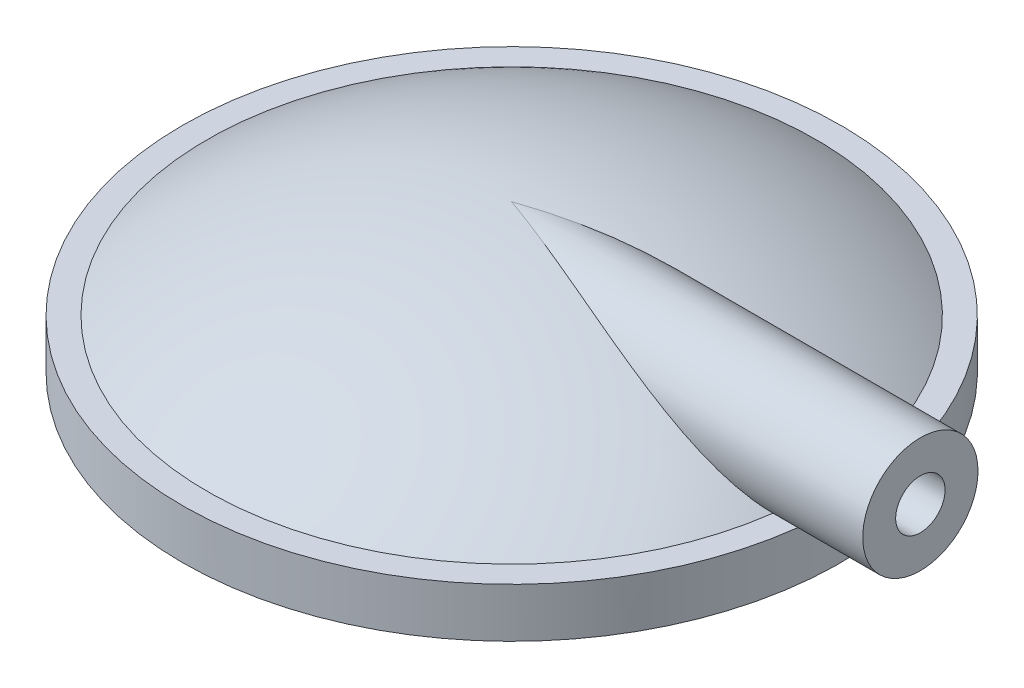
ISO-10303-21;
HEADER;
FILE_DESCRIPTION(('STEP AP214'),'2;1');
FILE_NAME('part.step','',(''),(''),'','','');
FILE_SCHEMA(('AUTOMOTIVE_DESIGN { 1 0 10303 214 1 1 1 1 }'));
ENDSEC;
DATA;
#1=APPLICATION_CONTEXT('core data for automotive mechanical design processes');
#2=APPLICATION_PROTOCOL_DEFINITION('international standard','automotive_design',2000,#1);
#3=PRODUCT_CONTEXT('',#1,'mechanical');
#4=PRODUCT('Part','Part','',(#3));
#5=PRODUCT_RELATED_PRODUCT_CATEGORY('part','',(#4));
#6=PRODUCT_DEFINITION_FORMATION('','',#4);
#7=PRODUCT_DEFINITION_CONTEXT('part definition',#1,'design');
#8=PRODUCT_DEFINITION('design','',#6,#7);
#9=PRODUCT_DEFINITION_SHAPE('','',#8);
#10=(LENGTH_UNIT() NAMED_UNIT(*) SI_UNIT(.MILLI.,.METRE.));
#11=(NAMED_UNIT(*) PLANE_ANGLE_UNIT() SI_UNIT($,.RADIAN.));
#12=(NAMED_UNIT(*) SI_UNIT($,.STERADIAN.) SOLID_ANGLE_UNIT());
#13=UNCERTAINTY_MEASURE_WITH_UNIT(LENGTH_MEASURE(1.E-05),#10,'distance_accuracy_value','');
#14=(GEOMETRIC_REPRESENTATION_CONTEXT(3) GLOBAL_UNCERTAINTY_ASSIGNED_CONTEXT((#13)) GLOBAL_UNIT_ASSIGNED_CONTEXT((#10,
#11,#12)) REPRESENTATION_CONTEXT('',''));
#15=CARTESIAN_POINT('',(0.,0.,0.));
#16=DIRECTION('',(0.,0.,1.));
#17=DIRECTION('',(1.,0.,0.));
#18=AXIS2_PLACEMENT_3D('',#15,#16,#17);
#19=CARTESIAN_POINT('',(0.,6.,0.));
#20=DIRECTION('',(0.,-1.,0.));
#21=DIRECTION('',(0.,0.,-1.));
#22=AXIS2_PLACEMENT_3D('',#19,#20,#21);
#23=CYLINDRICAL_SURFACE('',#22,40.);
#24=CARTESIAN_POINT('',(0.,6.,0.));
#25=DIRECTION('',(0.,1.,0.));
#26=DIRECTION('',(0.,0.,1.));
#27=AXIS2_PLACEMENT_3D('',#24,#25,#26);
#28=CIRCLE('',#27,40.);
#29=CARTESIAN_POINT('',(39.6950991937292,6.,-4.92941172960831));
#30=VERTEX_POINT('',#29);
#31=CARTESIAN_POINT('',(39.6950991937292,6.,4.92941172960831));
#32=VERTEX_POINT('',#31);
#33=EDGE_CURVE('E173',#30,#32,#28,.T.);
#34=ORIENTED_EDGE('',*,*,#33,.F.);
#35=CARTESIAN_POINT('',(39.6950991937292,6.,4.92941172960831));
#36=CARTESIAN_POINT('',(39.7124089481216,5.86175599387546,4.79005587591113));
#37=CARTESIAN_POINT('',(39.7296907381281,5.72939905118228,4.64485877047114));
#38=CARTESIAN_POINT('',(39.763727155769,5.47731215057956,4.34382920791582));
#39=CARTESIAN_POINT('',(39.7804817801748,5.35758226999677,4.18799668567998));
#40=CARTESIAN_POINT('',(39.8129895981926,5.13162360648108,3.86677295321004));
#41=CARTESIAN_POINT('',(39.8287429644965,5.02539249217585,3.70138340076855));
#42=CARTESIAN_POINT('',(39.8588112885689,4.82716349213925,3.36216366624986));
#43=CARTESIAN_POINT('',(39.8731262828514,4.73516524506705,3.18833369860328));
#44=CARTESIAN_POINT('',(39.8999247531419,4.5660186870106,2.83332125807261));
#45=CARTESIAN_POINT('',(39.9124070783221,4.48887969752044,2.65213425570237));
#46=CARTESIAN_POINT('',(39.9351814077428,4.35007503720658,2.28371551528999));
#47=CARTESIAN_POINT('',(39.9454726046854,4.28841506797077,2.09648157847928));
#48=CARTESIAN_POINT('',(39.9635611881141,4.18111050011879,1.7174820547218));
#49=CARTESIAN_POINT('',(39.9713600678191,4.13545631038297,1.52571925539109));
#50=CARTESIAN_POINT('',(39.9842502078612,4.06046807296974,1.13893558977569));
#51=CARTESIAN_POINT('',(39.9893414431704,4.03113417614697,0.943914693392335));
#52=CARTESIAN_POINT('',(39.9966347888947,3.98922524533224,0.553953742186143));
#53=CARTESIAN_POINT('',(39.9988646058533,3.97648947587996,0.359031467110364));
#54=CARTESIAN_POINT('',(40.0004637107225,3.96734922527556,-0.0312069763628184));
#55=CARTESIAN_POINT('',(39.9998330138688,3.97094465713947,-0.226523142656724));
#56=CARTESIAN_POINT('',(39.9957284243181,3.99444086479919,-0.6161809520254));
#57=CARTESIAN_POINT('',(39.9922539616603,4.01434490924424,-0.810522391884124));
#58=CARTESIAN_POINT('',(39.9825588799532,4.07030633834461,-1.19679197040681));
#59=CARTESIAN_POINT('',(39.9763383077087,4.1063634476866,-1.38872015014513));
#60=CARTESIAN_POINT('',(39.9613688126556,4.19409771261877,-1.76769894656301));
#61=CARTESIAN_POINT('',(39.9526347182014,4.24568333860155,-1.95477135036155));
#62=CARTESIAN_POINT('',(39.9328691152401,4.36413576523274,-2.32381220940502));
#63=CARTESIAN_POINT('',(39.9218384252854,4.4309971221303,-2.5057824570106));
#64=CARTESIAN_POINT('',(39.8977813231862,4.57951345282558,-2.86341703745549));
#65=CARTESIAN_POINT('',(39.8847552348083,4.66116602704271,-3.03908238760863));
#66=CARTESIAN_POINT('',(39.8570677919232,4.83864347493699,-3.3828846291112));
#67=CARTESIAN_POINT('',(39.842406796808,4.93446523538882,-3.55102316369216));
#68=CARTESIAN_POINT('',(39.8066304004521,5.17462960861355,-3.93456129602166));
#69=CARTESIAN_POINT('',(39.7850164141042,5.32438709724417,-4.14657182481707));
#70=CARTESIAN_POINT('',(39.7517350638019,5.56567114363342,-4.45084196711356));
#71=CARTESIAN_POINT('',(39.7405047734734,5.64881976565585,-4.54991992308442));
#72=CARTESIAN_POINT('',(39.7178870215497,5.82045787862826,-4.74330198066056));
#73=CARTESIAN_POINT('',(39.7064995738151,5.90894690086631,-4.83760649988501));
#74=CARTESIAN_POINT('',(39.6950991937292,6.,-4.92941172960831));
#75=B_SPLINE_CURVE_WITH_KNOTS('',3,(#35,#36,#37,#38,#39,#40,#41,#42,#43,#44,#45,#46,#47,#48,#49,
#50,#51,#52,#53,#54,#55,#56,#57,#58,#59,#60,#61,#62,#63,#64,#65,#66,#67,#68,#69,#70,#71,#72,#73,
#74),.UNSPECIFIED.,.F.,.F.,(4,2,2,2,2,2,2,2,2,2,2,2,2,2,2,2,2,2,2,4),(0.,0.590993715885996,
1.18199105074304,1.77288617529734,2.36376629587634,2.95501588817725,3.546482944597,
4.13759496885215,4.72871245688907,5.31406198085856,5.89940838711727,6.48487213997574,
7.07032591455175,7.65239426480573,8.23425550835753,8.81602244090404,9.39766173819213,
10.1772404969943,10.5665701271275,10.9558656364469),.UNSPECIFIED.);
#76=EDGE_CURVE('E120',#32,#30,#75,.T.);
#77=ORIENTED_EDGE('',*,*,#76,.F.);
#78=EDGE_LOOP('',(#34,#77));
#79=FACE_BOUND('',#78,.T.);
#80=CARTESIAN_POINT('',(0.,0.,0.));
#81=DIRECTION('',(0.,1.,0.));
#82=DIRECTION('',(0.,0.,1.));
#83=AXIS2_PLACEMENT_3D('',#80,#81,#82);
#84=CIRCLE('',#83,40.);
#85=CARTESIAN_POINT('',(0.,0.,40.));
#86=VERTEX_POINT('',#85);
#87=EDGE_CURVE('E176',#86,#86,#84,.T.);
#88=ORIENTED_EDGE('',*,*,#87,.T.);
#89=EDGE_LOOP('',(#88));
#90=FACE_BOUND('',#89,.T.);
#91=ADVANCED_FACE('F45',(#79,#90),#23,.T.);
#92=CARTESIAN_POINT('',(0.,6.,0.));
#93=DIRECTION('',(0.,1.,0.));
#94=DIRECTION('',(0.,0.,1.));
#95=AXIS2_PLACEMENT_3D('',#92,#93,#94);
#96=PLANE('',#95);
#97=DIRECTION('',(1.,0.,0.));
#98=VECTOR('',#97,1.);
#99=CARTESIAN_POINT('',(-40.002,6.,4.92941172960831));
#100=LINE('',#99,#98);
#101=CARTESIAN_POINT('',(36.6701636211239,6.,4.92941172960831));
#102=VERTEX_POINT('',#101);
#103=EDGE_CURVE('E67',#32,#102,#100,.F.);
#104=ORIENTED_EDGE('',*,*,#103,.T.);
#105=CARTESIAN_POINT('',(0.,6.,0.));
#106=DIRECTION('',(0.,-1.,0.));
#107=DIRECTION('',(0.,0.,-1.));
#108=AXIS2_PLACEMENT_3D('',#105,#106,#107);
#109=CIRCLE('',#108,37.);
#110=CARTESIAN_POINT('',(36.6701636211239,6.,-4.92941172960831));
#111=VERTEX_POINT('',#110);
#112=EDGE_CURVE('E181',#102,#111,#109,.T.);
#113=ORIENTED_EDGE('',*,*,#112,.T.);
#114=DIRECTION('',(1.,0.,0.));
#115=VECTOR('',#114,1.);
#116=CARTESIAN_POINT('',(-40.002,6.,-4.92941172960831));
#117=LINE('',#116,#115);
#118=EDGE_CURVE('E184',#111,#30,#117,.T.);
#119=ORIENTED_EDGE('',*,*,#118,.T.);
#120=ORIENTED_EDGE('',*,*,#33,.T.);
#121=EDGE_LOOP('',(#104,#113,#119,#120));
#122=FACE_BOUND('',#121,.T.);
#123=ADVANCED_FACE('F147',(#122),#96,.T.);
#124=CARTESIAN_POINT('',(0.,0.,0.));
#125=DIRECTION('',(0.,1.,0.));
#126=DIRECTION('',(0.,0.,1.));
#127=AXIS2_PLACEMENT_3D('',#124,#125,#126);
#128=PLANE('',#127);
#129=CARTESIAN_POINT('',(0.,0.,0.));
#130=DIRECTION('',(0.,1.,0.));
#131=DIRECTION('',(0.,0.,1.));
#132=AXIS2_PLACEMENT_3D('',#129,#130,#131);
#133=CIRCLE('',#132,38.);
#134=CARTESIAN_POINT('',(0.,0.,38.));
#135=VERTEX_POINT('',#134);
#136=EDGE_CURVE('E54',#135,#135,#133,.T.);
#137=ORIENTED_EDGE('',*,*,#136,.T.);
#138=EDGE_LOOP('',(#137));
#139=FACE_BOUND('',#138,.T.);
#140=ORIENTED_EDGE('',*,*,#87,.F.);
#141=EDGE_LOOP('',(#140));
#142=FACE_BOUND('',#141,.T.);
#143=ADVANCED_FACE('F145',(#139,#142),#128,.F.);
#144=CARTESIAN_POINT('',(0.,-45.1996282372598,0.));
#145=DIRECTION('',(0.,-1.,0.));
#146=DIRECTION('',(1.,0.,0.));
#147=AXIS2_PLACEMENT_3D('',#144,#145,#146);
#148=SPHERICAL_SURFACE('',#147,63.1696282372598);
#149=CARTESIAN_POINT('',(0.,17.97,0.));
#150=CARTESIAN_POINT('',(0.0158000399485056,17.9700000034911,0.00557771594320773));
#151=CARTESIAN_POINT('',(0.0316001302739456,17.9699933367733,0.0111554501623851));
#152=CARTESIAN_POINT('',(1.15560703518513,17.9690445711165,0.407950577175781));
#153=CARTESIAN_POINT('',(2.26405106759113,17.9352958766148,0.799195138560737));
#154=CARTESIAN_POINT('',(4.4803115009457,17.8022529608303,1.57307089203511));
#155=CARTESIAN_POINT('',(5.58812755681455,17.7029362899809,1.95569908758316));
#156=CARTESIAN_POINT('',(7.80413354253582,17.4388002226656,2.70414571704812));
#157=CARTESIAN_POINT('',(8.91232001709078,17.2738539384075,3.06993004762674));
#158=CARTESIAN_POINT('',(11.1256410284345,16.8790598042058,3.77439153750439));
#159=CARTESIAN_POINT('',(12.2307759563881,16.6492207036422,4.11307234322689));
#160=CARTESIAN_POINT('',(14.442269181809,16.1242490549561,4.75461831028505));
#161=CARTESIAN_POINT('',(15.5486061673744,15.8287970681459,5.05729672433669));
#162=CARTESIAN_POINT('',(17.7556376590261,15.1744929524595,5.61307224986112));
#163=CARTESIAN_POINT('',(18.8563305503074,14.8156236188407,5.86615586717214));
#164=CARTESIAN_POINT('',(20.4998135760095,14.2318368977105,6.19760758313226));
#165=CARTESIAN_POINT('',(21.0460154123152,14.0298126747566,6.30000958535239));
#166=CARTESIAN_POINT('',(22.1358661760039,13.6108850330902,6.48678225802725));
#167=CARTESIAN_POINT('',(22.6795149899975,13.393980960061,6.57115213487673));
#168=CARTESIAN_POINT('',(23.7633256024756,12.9459134762208,6.71948099408049));
#169=CARTESIAN_POINT('',(24.3034893816412,12.7147591329908,6.78345279916969));
#170=CARTESIAN_POINT('',(25.3799161894781,12.2386949943669,6.88838300389708));
#171=CARTESIAN_POINT('',(25.9161797882152,11.9937872567955,6.92934483631586));
#172=CARTESIAN_POINT('',(27.0350036574377,11.4669364933547,6.98783838516584));
#173=CARTESIAN_POINT('',(27.6170928747354,11.1836904824349,7.00275809316175));
#174=CARTESIAN_POINT('',(28.7741707980651,10.6028661066527,6.99640099388708));
#175=CARTESIAN_POINT('',(29.3491584131774,10.3052855733529,6.97511869338784));
#176=CARTESIAN_POINT('',(30.204038741683,9.84992899277604,6.91150082073885));
#177=CARTESIAN_POINT('',(30.487598164504,9.69672127429209,6.88503268835438));
#178=CARTESIAN_POINT('',(31.0519074688563,9.38759144222671,6.82062490753715));
#179=CARTESIAN_POINT('',(31.3326576441202,9.23166961720093,6.78268647165679));
#180=CARTESIAN_POINT('',(31.890733183268,8.91758975864149,6.69434159574032));
#181=CARTESIAN_POINT('',(32.1680603406785,8.75943299817762,6.64394200373961));
#182=CARTESIAN_POINT('',(32.7188382259563,8.44130462052401,6.52949308665112));
#183=CARTESIAN_POINT('',(32.9922891464898,8.28133309425283,6.46544444253751));
#184=CARTESIAN_POINT('',(33.512820572371,7.97307664035812,6.32807978358436));
#185=CARTESIAN_POINT('',(33.7602581352768,7.8248825937168,6.25591786011977));
#186=CARTESIAN_POINT('',(34.2504700282368,7.52810583753979,6.09767589209093));
#187=CARTESIAN_POINT('',(34.4932439342015,7.37952309404075,6.01159458840863));
#188=CARTESIAN_POINT('',(34.9721222874674,7.08340266359962,5.82450955343636));
#189=CARTESIAN_POINT('',(35.2082501821775,6.93586319664892,5.72356906598562));
#190=CARTESIAN_POINT('',(35.6735269422271,6.6422907045282,5.50494507534672));
#191=CARTESIAN_POINT('',(35.9026780966874,6.49625719587209,5.38726713730913));
#192=CARTESIAN_POINT('',(36.3545264839391,6.20563453695265,5.13211303959477));
#193=CARTESIAN_POINT('',(36.5771409083118,6.06107260619324,4.99445809523485));
#194=CARTESIAN_POINT('',(37.0110486139259,5.77683785315992,4.69820856328651));
#195=CARTESIAN_POINT('',(37.2223539470779,5.63715988349383,4.53963691710816));
#196=CARTESIAN_POINT('',(37.5298874780213,5.43224834630157,4.28316318921453));
#197=CARTESIAN_POINT('',(37.6315066421092,5.36425177125834,4.19387580159936));
#198=CARTESIAN_POINT('',(37.8304697578761,5.23060147910175,4.00902888081904));
#199=CARTESIAN_POINT('',(37.9278146364419,5.16494725462994,3.91347071880716));
#200=CARTESIAN_POINT('',(38.1179758438836,5.03622185389687,3.71541186965371));
#201=CARTESIAN_POINT('',(38.2107734590854,4.97316149949155,3.61288606341937));
#202=CARTESIAN_POINT('',(38.3907257098892,4.85045737532326,3.40090808760867));
#203=CARTESIAN_POINT('',(38.477875856254,4.79081632784402,3.29145054131153));
#204=CARTESIAN_POINT('',(38.5617711619251,4.73321847045555,3.17845184842136));
#205=B_SPLINE_CURVE_WITH_KNOTS('',3,(#149,#150,#151,#152,#153,#154,#155,#156,#157,#158,#159,
#160,#161,#162,#163,#164,#165,#166,#167,#168,#169,#170,#171,#172,#173,#174,#175,#176,#177,#178,
#179,#180,#181,#182,#183,#184,#185,#186,#187,#188,#189,#190,#191,#192,#193,#194,#195,#196,#197,
#198,#199,#200,#201,#202,#203,#204),.UNSPECIFIED.,.F.,.F.,(4,2,2,2,2,2,2,2,2,2,2,2,2,2,2,2,2,2,
2,2,2,2,2,2,2,2,2,4),(0.,0.0502671416483039,3.57595688830025,7.10285440875227,10.6366042004549,
14.1698777704556,17.7207457765803,21.2725785947906,23.0461003301407,24.8197001032396,
26.592182739277,28.3644008743039,30.3059140496408,32.2477218530283,33.2176981414054,
34.1875719271695,35.1569138983278,36.1262075187023,37.0178191189692,37.9095114177227,
38.7975127040664,39.6852194199778,40.5814262058689,41.4766580820746,41.9306893622315,
42.3846216936239,42.8402875401473,43.2963112665182),.UNSPECIFIED.);
#206=CARTESIAN_POINT('',(0.,17.97,0.));
#207=VERTEX_POINT('',#206);
#208=EDGE_CURVE('E134',#207,#102,#205,.T.);
#209=ORIENTED_EDGE('',*,*,#208,.F.);
#210=CARTESIAN_POINT('',(0.,17.97,0.));
#211=CARTESIAN_POINT('',(0.0158000399485056,17.9700000034911,-0.00557771594320773));
#212=CARTESIAN_POINT('',(0.0316001302739456,17.9699933367733,-0.0111554501623851));
#213=CARTESIAN_POINT('',(1.15560703518513,17.9690445711165,-0.407950577175781));
#214=CARTESIAN_POINT('',(2.26405106759113,17.9352958766148,-0.799195138560737));
#215=CARTESIAN_POINT('',(4.4803115009457,17.8022529608303,-1.57307089203511));
#216=CARTESIAN_POINT('',(5.58812755681455,17.7029362899809,-1.95569908758316));
#217=CARTESIAN_POINT('',(7.80413354253582,17.4388002226656,-2.70414571704812));
#218=CARTESIAN_POINT('',(8.91232001709078,17.2738539384075,-3.06993004762674));
#219=CARTESIAN_POINT('',(11.1256410284345,16.8790598042058,-3.77439153750439));
#220=CARTESIAN_POINT('',(12.2307759563881,16.6492207036422,-4.11307234322689));
#221=CARTESIAN_POINT('',(14.442269181809,16.1242490549561,-4.75461831028505));
#222=CARTESIAN_POINT('',(15.5486061673744,15.8287970681459,-5.05729672433669));
#223=CARTESIAN_POINT('',(17.7556376590261,15.1744929524595,-5.61307224986112));
#224=CARTESIAN_POINT('',(18.8563305503074,14.8156236188407,-5.86615586717214));
#225=CARTESIAN_POINT('',(20.4998135760095,14.2318368977105,-6.19760758313226));
#226=CARTESIAN_POINT('',(21.0460154123152,14.0298126747566,-6.30000958535239));
#227=CARTESIAN_POINT('',(22.1358661760039,13.6108850330902,-6.48678225802725));
#228=CARTESIAN_POINT('',(22.6795149899975,13.393980960061,-6.57115213487673));
#229=CARTESIAN_POINT('',(23.7633256024756,12.9459134762208,-6.71948099408049));
#230=CARTESIAN_POINT('',(24.3034893816412,12.7147591329908,-6.78345279916969));
#231=CARTESIAN_POINT('',(25.3799161894781,12.2386949943669,-6.88838300389708));
#232=CARTESIAN_POINT('',(25.9161797882152,11.9937872567955,-6.92934483631586));
#233=CARTESIAN_POINT('',(27.0350036574377,11.4669364933547,-6.98783838516584));
#234=CARTESIAN_POINT('',(27.6170928747354,11.1836904824349,-7.00275809316175));
#235=CARTESIAN_POINT('',(28.7741707980651,10.6028661066527,-6.99640099388708));
#236=CARTESIAN_POINT('',(29.3491584131774,10.3052855733529,-6.97511869338784));
#237=CARTESIAN_POINT('',(30.204038741683,9.84992899277604,-6.91150082073885));
#238=CARTESIAN_POINT('',(30.487598164504,9.69672127429209,-6.88503268835438));
#239=CARTESIAN_POINT('',(31.0519074688563,9.38759144222671,-6.82062490753715));
#240=CARTESIAN_POINT('',(31.3326576441202,9.23166961720093,-6.78268647165679));
#241=CARTESIAN_POINT('',(31.890733183268,8.91758975864149,-6.69434159574032));
#242=CARTESIAN_POINT('',(32.1680603406785,8.75943299817762,-6.64394200373961));
#243=CARTESIAN_POINT('',(32.7188382259563,8.44130462052401,-6.52949308665112));
#244=CARTESIAN_POINT('',(32.9922891464898,8.28133309425283,-6.46544444253751));
#245=CARTESIAN_POINT('',(33.512820572371,7.97307664035812,-6.32807978358436));
#246=CARTESIAN_POINT('',(33.7602581352768,7.8248825937168,-6.25591786011977));
#247=CARTESIAN_POINT('',(34.2504700282368,7.52810583753979,-6.09767589209093));
#248=CARTESIAN_POINT('',(34.4932439342015,7.37952309404075,-6.01159458840863));
#249=CARTESIAN_POINT('',(34.9721222874674,7.08340266359962,-5.82450955343636));
#250=CARTESIAN_POINT('',(35.2082501821775,6.93586319664892,-5.72356906598562));
#251=CARTESIAN_POINT('',(35.6735269422271,6.6422907045282,-5.50494507534672));
#252=CARTESIAN_POINT('',(35.9026780966874,6.49625719587209,-5.38726713730913));
#253=CARTESIAN_POINT('',(36.3545264839391,6.20563453695265,-5.13211303959477));
#254=CARTESIAN_POINT('',(36.5771409083118,6.06107260619324,-4.99445809523485));
#255=CARTESIAN_POINT('',(37.0110486139259,5.77683785315992,-4.69820856328651));
#256=CARTESIAN_POINT('',(37.2223539470779,5.63715988349383,-4.53963691710816));
#257=CARTESIAN_POINT('',(37.5298874780213,5.43224834630157,-4.28316318921453));
#258=CARTESIAN_POINT('',(37.6315066421092,5.36425177125834,-4.19387580159936));
#259=CARTESIAN_POINT('',(37.8304697578761,5.23060147910175,-4.00902888081904));
#260=CARTESIAN_POINT('',(37.9278146364419,5.16494725462994,-3.91347071880716));
#261=CARTESIAN_POINT('',(38.1179758438836,5.03622185389687,-3.71541186965371));
#262=CARTESIAN_POINT('',(38.2107734590854,4.97316149949155,-3.61288606341937));
#263=CARTESIAN_POINT('',(38.3907257098892,4.85045737532326,-3.40090808760867));
#264=CARTESIAN_POINT('',(38.477875856254,4.79081632784402,-3.29145054131153));
#265=CARTESIAN_POINT('',(38.5617711619251,4.73321847045555,-3.17845184842136));
#266=B_SPLINE_CURVE_WITH_KNOTS('',3,(#210,#211,#212,#213,#214,#215,#216,#217,#218,#219,#220,
#221,#222,#223,#224,#225,#226,#227,#228,#229,#230,#231,#232,#233,#234,#235,#236,#237,#238,#239,
#240,#241,#242,#243,#244,#245,#246,#247,#248,#249,#250,#251,#252,#253,#254,#255,#256,#257,#258,
#259,#260,#261,#262,#263,#264,#265),.UNSPECIFIED.,.F.,.F.,(4,2,2,2,2,2,2,2,2,2,2,2,2,2,2,2,2,2,
2,2,2,2,2,2,2,2,2,4),(0.,0.0502671416483039,3.57595688830025,7.10285440875227,10.6366042004549,
14.1698777704556,17.7207457765803,21.2725785947906,23.0461003301407,24.8197001032396,
26.592182739277,28.3644008743039,30.3059140496408,32.2477218530283,33.2176981414054,
34.1875719271695,35.1569138983278,36.1262075187023,37.0178191189692,37.9095114177227,
38.7975127040664,39.6852194199778,40.5814262058689,41.4766580820746,41.9306893622315,
42.3846216936239,42.8402875401473,43.2963112665182),.UNSPECIFIED.);
#267=EDGE_CURVE('E61',#111,#207,#266,.F.);
#268=ORIENTED_EDGE('',*,*,#267,.F.);
#269=ORIENTED_EDGE('',*,*,#112,.F.);
#270=EDGE_LOOP('',(#209,#268,#269));
#271=FACE_BOUND('',#270,.T.);
#272=ADVANCED_FACE('F109',(#271),#148,.T.);
#273=CARTESIAN_POINT('',(49.646,10.97,0.));
#274=DIRECTION('',(1.,0.,0.));
#275=DIRECTION('',(0.,0.,-1.));
#276=AXIS2_PLACEMENT_3D('',#273,#274,#275);
#277=PLANE('',#276);
#278=CARTESIAN_POINT('',(49.646,10.97,0.));
#279=DIRECTION('',(1.,0.,0.));
#280=DIRECTION('',(0.,0.,-1.));
#281=AXIS2_PLACEMENT_3D('',#278,#279,#280);
#282=CIRCLE('',#281,3.);
#283=CARTESIAN_POINT('',(49.646,10.97,-3.));
#284=VERTEX_POINT('',#283);
#285=EDGE_CURVE('E84',#284,#284,#282,.T.);
#286=ORIENTED_EDGE('',*,*,#285,.F.);
#287=EDGE_LOOP('',(#286));
#288=FACE_BOUND('',#287,.T.);
#289=CARTESIAN_POINT('',(49.646,10.97,0.));
#290=DIRECTION('',(1.,0.,0.));
#291=DIRECTION('',(0.,0.,-1.));
#292=AXIS2_PLACEMENT_3D('',#289,#290,#291);
#293=CIRCLE('',#292,7.);
#294=CARTESIAN_POINT('',(49.646,10.97,-7.));
#295=VERTEX_POINT('',#294);
#296=EDGE_CURVE('E89',#295,#295,#293,.T.);
#297=ORIENTED_EDGE('',*,*,#296,.T.);
#298=EDGE_LOOP('',(#297));
#299=FACE_BOUND('',#298,.T.);
#300=ADVANCED_FACE('F106',(#288,#299),#277,.T.);
#301=CARTESIAN_POINT('',(-40.002,10.97,0.));
#302=DIRECTION('',(1.,0.,0.));
#303=DIRECTION('',(0.,0.,-1.));
#304=AXIS2_PLACEMENT_3D('',#301,#302,#303);
#305=CYLINDRICAL_SURFACE('',#304,7.);
#306=ORIENTED_EDGE('',*,*,#296,.F.);
#307=EDGE_LOOP('',(#306));
#308=FACE_BOUND('',#307,.T.);
#309=ORIENTED_EDGE('',*,*,#267,.T.);
#310=ORIENTED_EDGE('',*,*,#208,.T.);
#311=ORIENTED_EDGE('',*,*,#103,.F.);
#312=ORIENTED_EDGE('',*,*,#76,.T.);
#313=ORIENTED_EDGE('',*,*,#118,.F.);
#314=EDGE_LOOP('',(#309,#310,#311,#312,#313));
#315=FACE_BOUND('',#314,.T.);
#316=ADVANCED_FACE('F105',(#308,#315),#305,.T.);
#317=CARTESIAN_POINT('',(0.,-45.1996282372598,0.));
#318=DIRECTION('',(0.,-1.,0.));
#319=DIRECTION('',(1.,0.,0.));
#320=AXIS2_PLACEMENT_3D('',#317,#318,#319);
#321=SPHERICAL_SURFACE('',#320,59.1696282372598);
#322=CARTESIAN_POINT('',(0.,13.97,0.));
#323=CARTESIAN_POINT('',(-2.33029722934459E-08,13.97,0.000131928525349912));
#324=CARTESIAN_POINT('',(0.000935592805637801,13.9699999913602,0.000263857338338834));
#325=CARTESIAN_POINT('',(0.00322680961842565,13.9699999399904,0.000655032049908774));
#326=CARTESIAN_POINT('',(0.00410746594509743,13.969999872297,0.000913458453646124));
#327=CARTESIAN_POINT('',(0.00795823096337418,13.9699994678997,0.00194633190853286));
#328=CARTESIAN_POINT('',(0.0115953863814709,13.9699988639384,0.00272300736164359));
#329=CARTESIAN_POINT('',(0.0265025903761319,13.9699950604546,0.00598645848634254));
#330=CARTESIAN_POINT('',(0.0369319427075086,13.9699890740929,0.00847038345995072));
#331=CARTESIAN_POINT('',(0.179182747257677,13.9698657690433,0.0422253649362371));
#332=CARTESIAN_POINT('',(0.317141637996946,13.9692622092647,0.0735161673504512));
#333=CARTESIAN_POINT('',(0.592104306220262,13.9670583407187,0.136579418603193));
#334=CARTESIAN_POINT('',(0.729054265336124,13.9654416614945,0.168351245558482));
#335=CARTESIAN_POINT('',(1.12713954800389,13.9592864448043,0.260424952972116));
#336=CARTESIAN_POINT('',(1.38908638598002,13.9534277426641,0.320662646183186));
#337=CARTESIAN_POINT('',(1.94693014199854,13.937045266465,0.448710482312192));
#338=CARTESIAN_POINT('',(2.24274326596551,13.9260076925803,0.516470360235561));
#339=CARTESIAN_POINT('',(2.8379260489939,13.8991028357876,0.65206491531557));
#340=CARTESIAN_POINT('',(3.13729740965088,13.8831813622954,0.71989145615066));
#341=CARTESIAN_POINT('',(3.64526756979972,13.8521037950894,0.834173026711729));
#342=CARTESIAN_POINT('',(3.85390179725407,13.8381759254212,0.88088009133058));
#343=CARTESIAN_POINT('',(4.27057822347307,13.8080390823001,0.973603745983372));
#344=CARTESIAN_POINT('',(4.47862051138161,13.7918363177545,1.01962185018201));
#345=CARTESIAN_POINT('',(4.88898337693128,13.7575968693966,1.10975859828353));
#346=CARTESIAN_POINT('',(5.09130531671324,13.7396222253285,1.15389482356644));
#347=CARTESIAN_POINT('',(5.49606069067864,13.7014768451836,1.24149846980885));
#348=CARTESIAN_POINT('',(5.69849408026469,13.681304320579,1.28496531273372));
#349=CARTESIAN_POINT('',(6.48009388345618,13.5991930599187,1.45128845424819));
#350=CARTESIAN_POINT('',(7.05906857558705,13.5294090264387,1.57130514242641));
#351=CARTESIAN_POINT('',(8.2162069857863,13.3720669046074,1.80267716223228));
#352=CARTESIAN_POINT('',(8.79437084023692,13.2845122926969,1.91403418205799));
#353=CARTESIAN_POINT('',(9.95657661516356,13.0905940264401,2.12698485119393));
#354=CARTESIAN_POINT('',(10.5406077989925,12.9840214947677,2.22844843690864));
#355=CARTESIAN_POINT('',(11.707410053983,12.7529449713063,2.4173072253108));
#356=CARTESIAN_POINT('',(12.2901811107939,12.6284407763887,2.50470226860711));
#357=CARTESIAN_POINT('',(13.5051092800354,12.3500191331907,2.66907297572933));
#358=CARTESIAN_POINT('',(14.1371170676108,12.1944799958131,2.74446354672984));
#359=CARTESIAN_POINT('',(15.0830845125,11.945775328796,2.83825600262549));
#360=CARTESIAN_POINT('',(15.3981351745618,11.8602873364561,2.86630862356951));
#361=CARTESIAN_POINT('',(16.0273809985978,11.6842631219636,2.91516331927758));
#362=CARTESIAN_POINT('',(16.3415762077974,11.5937271846631,2.93596580268265));
#363=CARTESIAN_POINT('',(16.9673412749776,11.4081771923823,2.96931652136425));
#364=CARTESIAN_POINT('',(17.2789163528216,11.313188304572,2.98190627341615));
#365=CARTESIAN_POINT('',(17.90079275545,11.118443686896,2.99791797021417));
#366=CARTESIAN_POINT('',(18.2110941901235,11.018688378079,3.00134072322213));
#367=CARTESIAN_POINT('',(18.8299195833736,10.8146453309644,2.99771106055034));
#368=CARTESIAN_POINT('',(19.1384446031113,10.7103607069455,2.99066573522265));
#369=CARTESIAN_POINT('',(19.7534469508698,10.4974457746455,2.96449107604925));
#370=CARTESIAN_POINT('',(20.0599246889513,10.3888163690372,2.94536424017083));
#371=CARTESIAN_POINT('',(20.494716418172,10.2311771841957,2.90800052591911));
#372=CARTESIAN_POINT('',(20.6241368245346,10.1838049158368,2.89557676588984));
#373=CARTESIAN_POINT('',(20.8824252644836,10.0883737432146,2.86796138136452));
#374=CARTESIAN_POINT('',(21.0112933093222,10.0403148530258,2.85276981352819));
#375=CARTESIAN_POINT('',(21.397092370918,9.89511623358665,2.80270068091809));
#376=CARTESIAN_POINT('',(21.6530947241532,9.7969993872567,2.76333888655153));
#377=CARTESIAN_POINT('',(22.1585908031047,9.59984375937598,2.67102901325354));
#378=CARTESIAN_POINT('',(22.408125873441,9.50083150811244,2.61825550792186));
#379=CARTESIAN_POINT('',(22.7788241802334,9.35131583345908,2.52651140946897));
#380=CARTESIAN_POINT('',(22.9017625005162,9.30132234018942,2.49384144048378));
#381=CARTESIAN_POINT('',(23.1462002127894,9.20112690246532,2.42380482470043));
#382=CARTESIAN_POINT('',(23.2676997937121,9.15092498657656,2.38643880223324));
#383=CARTESIAN_POINT('',(23.4790253407957,9.06293170338914,2.31633803133357));
#384=CARTESIAN_POINT('',(23.5692350098585,9.02514954600973,2.2847522270443));
#385=CARTESIAN_POINT('',(23.7484507345775,8.94966350834205,2.2182792504009));
#386=CARTESIAN_POINT('',(23.8374568014163,8.91195962732929,2.18339210874321));
#387=CARTESIAN_POINT('',(24.1030049758653,8.79884646981355,2.07298953201042));
#388=CARTESIAN_POINT('',(24.2774602407581,8.72369274116793,1.99193193167128));
#389=CARTESIAN_POINT('',(24.5332295863834,8.61237190439447,1.85607864472129));
#390=CARTESIAN_POINT('',(24.6178530858751,8.57534302187167,1.80817806376114));
#391=CARTESIAN_POINT('',(24.78420371123,8.50218871745257,1.70698941589609));
#392=CARTESIAN_POINT('',(24.8659319705782,8.46606294365703,1.6537034895472));
#393=CARTESIAN_POINT('',(25.0253731828357,8.39525268563173,1.5411306390079));
#394=CARTESIAN_POINT('',(25.1030986994729,8.36056376825127,1.48186447053306));
#395=CARTESIAN_POINT('',(25.2534964670864,8.29314702035871,1.35629450681429));
#396=CARTESIAN_POINT('',(25.3261735042231,8.26041733660076,1.28999753202021));
#397=CARTESIAN_POINT('',(25.4585431094255,8.20057040487939,1.15550268049985));
#398=CARTESIAN_POINT('',(25.5188155605033,8.17321277940955,1.08799043234859));
#399=CARTESIAN_POINT('',(25.6316146146882,8.12185298657076,0.945410044052382));
#400=CARTESIAN_POINT('',(25.6841359297979,8.09785311050832,0.870336803840183));
#401=CARTESIAN_POINT('',(25.7790567860164,8.05436990381322,0.711320086343402));
#402=CARTESIAN_POINT('',(25.8213215818472,8.03494678742808,0.627277451107925));
#403=CARTESIAN_POINT('',(25.890888467166,8.00292410786316,0.45201510595849));
#404=CARTESIAN_POINT('',(25.9182317728344,7.99030574971187,0.360815970057679));
#405=CARTESIAN_POINT('',(25.949991741702,7.97564050893527,0.19703946944032));
#406=CARTESIAN_POINT('',(25.9583924983082,7.97175718699205,0.125396963429611));
#407=CARTESIAN_POINT('',(25.96393274461,7.96919660678073,-0.0184174176478336));
#408=CARTESIAN_POINT('',(25.9610759488483,7.97051763128614,-0.0905891102598797));
#409=CARTESIAN_POINT('',(25.9443976598904,7.97822359120444,-0.233167358172798));
#410=CARTESIAN_POINT('',(25.9306020377181,7.98459657839343,-0.303577674430707));
#411=CARTESIAN_POINT('',(25.8932972975989,8.00180578095734,-0.441187493799294));
#412=CARTESIAN_POINT('',(25.8697806009032,8.01264547865045,-0.508384446000996));
#413=CARTESIAN_POINT('',(25.8020888170722,8.04378850359156,-0.668291072182242));
#414=CARTESIAN_POINT('',(25.753383325321,8.06615336095957,-0.758668556241332));
#415=CARTESIAN_POINT('',(25.6436446657017,8.11636056858107,-0.929926838937374));
#416=CARTESIAN_POINT('',(25.5825789976108,8.14421735435303,-1.01078169291071));
#417=CARTESIAN_POINT('',(25.4617155912503,8.19912445560346,-1.15198832510168));
#418=CARTESIAN_POINT('',(25.403118512466,8.22566149244352,-1.21359255125332));
#419=CARTESIAN_POINT('',(25.2812051190465,8.28066544174391,-1.33104829229432));
#420=CARTESIAN_POINT('',(25.2178852964671,8.30913378728706,-1.38689545613244));
#421=CARTESIAN_POINT('',(25.087585853989,8.36748194671528,-1.49351876336948));
#422=CARTESIAN_POINT('',(25.0206009641139,8.39736378422445,-1.5442872911342));
#423=CARTESIAN_POINT('',(24.8838238135956,8.45812448524833,-1.64126453833239));
#424=CARTESIAN_POINT('',(24.8140304564658,8.48900373722861,-1.68747145201592));
#425=CARTESIAN_POINT('',(24.5945763674607,8.58567387624909,-1.82425282917494));
#426=CARTESIAN_POINT('',(24.4411679270941,8.65265765975466,-1.90798853936217));
#427=CARTESIAN_POINT('',(24.1280459550857,8.78803599373796,-2.06142480850378));
#428=CARTESIAN_POINT('',(23.9683257365927,8.8564320016409,-2.13110997783323));
#429=CARTESIAN_POINT('',(23.6440907356697,8.99385282094509,-2.25913259004986));
#430=CARTESIAN_POINT('',(23.4795634632273,9.06287887638745,-2.31743675392259));
#431=CARTESIAN_POINT('',(23.1474347463709,9.20073091861143,-2.42430924248287));
#432=CARTESIAN_POINT('',(22.9798346929432,9.26955698034076,-2.4728818592002));
#433=CARTESIAN_POINT('',(22.5593756841506,9.44030871157485,-2.58358563456165));
#434=CARTESIAN_POINT('',(22.305052354049,9.54189686843775,-2.64066730554817));
#435=CARTESIAN_POINT('',(21.7926636120144,9.74303181354721,-2.739908526809));
#436=CARTESIAN_POINT('',(21.5345965739471,9.84257766643136,-2.78206137742627));
#437=CARTESIAN_POINT('',(21.015363051825,10.0392460521798,-2.85388667124892));
#438=CARTESIAN_POINT('',(20.7541922722872,10.1363644564864,-2.88353905441764));
#439=CARTESIAN_POINT('',(20.2297843353764,10.3276810496978,-2.93209146440755));
#440=CARTESIAN_POINT('',(19.9665469740877,10.4218789457708,-2.95099041628611));
#441=CARTESIAN_POINT('',(19.43903188075,10.6069143518835,-2.97941449310956));
#442=CARTESIAN_POINT('',(19.1747575399601,10.697758566119,-2.98895941674105));
#443=CARTESIAN_POINT('',(18.6449299338981,10.8761286185436,-2.9998602838219));
#444=CARTESIAN_POINT('',(18.3793766311547,10.9636543588327,-3.00121598586376));
#445=CARTESIAN_POINT('',(17.5816790855028,11.2208904074114,-2.99441531160929));
#446=CARTESIAN_POINT('',(17.0479501636192,11.3854516248215,-2.97541648104598));
#447=CARTESIAN_POINT('',(15.8880081210919,11.7264529319726,-2.90908478521435));
#448=CARTESIAN_POINT('',(15.2612754290507,11.9002672154533,-2.85753974341703));
#449=CARTESIAN_POINT('',(14.3146454118572,12.1468839790318,-2.76095318501493));
#450=CARTESIAN_POINT('',(13.9957063865428,12.2272621924524,-2.72521934924504));
#451=CARTESIAN_POINT('',(13.3573539191986,12.3826912523637,-2.64798719895221));
#452=CARTESIAN_POINT('',(13.0379407018476,12.4577440994802,-2.60649106671097));
#453=CARTESIAN_POINT('',(12.217432181141,12.6435285333846,-2.49337807062092));
#454=CARTESIAN_POINT('',(11.7159680439175,12.7503730552272,-2.41801927565484));
#455=CARTESIAN_POINT('',(10.7111943576741,12.9509722291433,-2.25662313787324));
#456=CARTESIAN_POINT('',(10.207883111363,13.0447028635266,-2.17056673307866));
#457=CARTESIAN_POINT('',(9.23302367056094,13.2131255913542,-1.99553734899556));
#458=CARTESIAN_POINT('',(8.76152137886939,13.2886558783477,-1.90711080878082));
#459=CARTESIAN_POINT('',(7.82119068477771,13.4274338976373,-1.72455094085934));
#460=CARTESIAN_POINT('',(7.35236576375125,13.4907612399091,-1.63046025119942));
#461=CARTESIAN_POINT('',(6.64320867545498,13.5776656987358,-1.48438277415717));
#462=CARTESIAN_POINT('',(6.40301258291038,13.6055606020435,-1.43425483022936));
#463=CARTESIAN_POINT('',(5.92269968788882,13.6582591039117,-1.33286348223549));
#464=CARTESIAN_POINT('',(5.68258295047691,13.683064886476,-1.28160091089651));
#465=CARTESIAN_POINT('',(5.19632081792499,13.7301801956428,-1.17677055208264));
#466=CARTESIAN_POINT('',(4.95017350630889,13.7524126138081,-1.12317712027007));
#467=CARTESIAN_POINT('',(4.45714440544427,13.7937017906068,-1.01492514784344));
#468=CARTESIAN_POINT('',(4.21026242536636,13.8127498248377,-0.960264124945775));
#469=CARTESIAN_POINT('',(3.61764230084147,13.8545658315086,-0.828139986546135));
#470=CARTESIAN_POINT('',(3.27188042081749,13.8757720374983,-0.750305534100703));
#471=CARTESIAN_POINT('',(2.5841699200629,13.9115951754574,-0.594424002572999));
#472=CARTESIAN_POINT('',(2.2422229243878,13.9262847098731,-0.516389541266257));
#473=CARTESIAN_POINT('',(1.74965301498734,13.9429527945773,-0.403450071670379));
#474=CARTESIAN_POINT('',(1.59895765093269,13.9474460835088,-0.368825938820534));
#475=CARTESIAN_POINT('',(1.29663446285634,13.9552363504241,-0.299319415321909));
#476=CARTESIAN_POINT('',(1.14500546698358,13.9585279357726,-0.264436560275023));
#477=CARTESIAN_POINT('',(0.835122895896004,13.9640213822873,-0.192845428214662));
#478=CARTESIAN_POINT('',(0.676919964891965,13.9661600651975,-0.156133633252218));
#479=CARTESIAN_POINT('',(0.359159126730024,13.96906237878,-0.0832577651963596));
#480=CARTESIAN_POINT('',(0.19966597417344,13.9698479816453,-0.0470945817366828));
#481=CARTESIAN_POINT('',(0.0369334304127483,13.9699890750197,-0.00847013771493662));
#482=CARTESIAN_POINT('',(0.0265007434009974,13.9699950616778,-0.00598595046092496));
#483=CARTESIAN_POINT('',(0.0115928882399471,13.9699988644035,-0.00272244026021425));
#484=CARTESIAN_POINT('',(0.00795677793810287,13.969999468092,-0.00194596032072645));
#485=CARTESIAN_POINT('',(0.00410686080933524,13.9699998723321,-0.000913328485335896));
#486=CARTESIAN_POINT('',(0.00322634381751999,13.9699999400034,-0.000654951114471343));
#487=CARTESIAN_POINT('',(0.000935546265615181,13.9699999913615,-0.000263837057336045));
#488=CARTESIAN_POINT('',(2.33012319459425E-08,13.97,-0.000131918672466047));
#489=CARTESIAN_POINT('',(0.,13.97,0.));
#490=B_SPLINE_CURVE_WITH_KNOTS('',3,(#322,#323,#324,#325,#326,#327,#328,#329,#330,#331,#332,
#333,#334,#335,#336,#337,#338,#339,#340,#341,#342,#343,#344,#345,#346,#347,#348,#349,#350,#351,
#352,#353,#354,#355,#356,#357,#358,#359,#360,#361,#362,#363,#364,#365,#366,#367,#368,#369,#370,
#371,#372,#373,#374,#375,#376,#377,#378,#379,#380,#381,#382,#383,#384,#385,#386,#387,#388,#389,
#390,#391,#392,#393,#394,#395,#396,#397,#398,#399,#400,#401,#402,#403,#404,#405,#406,#407,#408,
#409,#410,#411,#412,#413,#414,#415,#416,#417,#418,#419,#420,#421,#422,#423,#424,#425,#426,#427,
#428,#429,#430,#431,#432,#433,#434,#435,#436,#437,#438,#439,#440,#441,#442,#443,#444,#445,#446,
#447,#448,#449,#450,#451,#452,#453,#454,#455,#456,#457,#458,#459,#460,#461,#462,#463,#464,#465,
#466,#467,#468,#469,#470,#471,#472,#473,#474,#475,#476,#477,#478,#479,#480,#481,#482,#483,#484,
#485,#486,#487,#488,#489),.UNSPECIFIED.,.T.,.F.,(4,2,2,2,2,2,2,2,2,2,2,2,2,2,2,2,2,2,2,2,2,2,2,
2,2,2,2,2,2,2,2,2,2,2,2,2,2,2,2,2,2,2,2,2,2,2,2,2,2,2,2,2,2,2,2,2,2,2,2,2,2,2,2,2,2,2,2,2,2,2,2,
2,2,2,2,2,2,2,2,2,2,2,2,4),(0.,0.0017519002458126,0.0052056631315465,0.0155408830614295,
0.0486496214352852,0.465445146899375,0.889155526783352,1.69429475568091,2.6057362103396,
3.52768088435758,4.17044248106719,4.81148270080685,5.43504658178393,6.05912173288055,
7.84493207832822,9.63039340359601,11.4368295386684,13.243286138521,15.2081081219595,
16.1909504097461,17.1737372924258,18.1515167056694,19.1292099044603,20.1062411833275,
21.0830705177741,21.4981751405485,21.9132712666835,22.7438587703432,23.5641440572297,
23.9741035489869,24.384008594989,24.6922766443924,25.0005418277444,25.6191598696026,
25.9311771508575,26.2430708962727,26.5539171306258,26.8644645306078,27.147570777826,
27.4308692823482,27.7177094306204,28.0037532053233,28.2194650168182,28.4351056579927,
28.6502378110126,28.865538002739,29.1789748954814,29.493246912708,29.7600682732085,
30.0270898348828,30.2945059865371,30.5620275759856,31.1225699091898,31.6837229111795,
32.2464929682858,32.8090142706013,33.6476807450397,34.4867231151576,35.3271068538867,
36.167574584938,37.0062595194053,37.8449691770831,39.5206503511869,41.4769518076309,
42.4694171419064,43.4615076322406,45.0158774324423,46.5730577576285,48.0297662017859,
49.4766232274574,50.2174601556384,50.9577703032298,51.7164291639065,52.4771336520054,
53.5422556946734,54.5951933546696,55.0593967999969,55.5256584681635,56.0153852794133,
56.4970818632973,56.5301939841712,56.5405266179772,56.5439797153238,56.5457314847316),.UNSPECIFIED.);
#491=CARTESIAN_POINT('',(0.,13.97,0.));
#492=VERTEX_POINT('',#491);
#493=EDGE_CURVE('E79',#492,#492,#490,.T.);
#494=ORIENTED_EDGE('',*,*,#493,.T.);
#495=EDGE_LOOP('',(#494));
#496=FACE_BOUND('',#495,.T.);
#497=CARTESIAN_POINT('',(0.,2.,0.));
#498=DIRECTION('',(0.,1.,0.));
#499=DIRECTION('',(0.,0.,1.));
#500=AXIS2_PLACEMENT_3D('',#497,#498,#499);
#501=CIRCLE('',#500,35.6824887024434);
#502=CARTESIAN_POINT('',(0.,2.,35.6824887024434));
#503=VERTEX_POINT('',#502);
#504=EDGE_CURVE('E83',#503,#503,#501,.F.);
#505=ORIENTED_EDGE('',*,*,#504,.T.);
#506=EDGE_LOOP('',(#505));
#507=FACE_BOUND('',#506,.T.);
#508=ADVANCED_FACE('F101',(#496,#507),#321,.F.);
#509=CARTESIAN_POINT('',(-40.002,10.97,0.));
#510=DIRECTION('',(1.,0.,0.));
#511=DIRECTION('',(0.,0.,-1.));
#512=AXIS2_PLACEMENT_3D('',#509,#510,#511);
#513=CYLINDRICAL_SURFACE('',#512,3.);
#514=ORIENTED_EDGE('',*,*,#285,.T.);
#515=EDGE_LOOP('',(#514));
#516=FACE_BOUND('',#515,.T.);
#517=ORIENTED_EDGE('',*,*,#493,.F.);
#518=EDGE_LOOP('',(#517));
#519=FACE_BOUND('',#518,.T.);
#520=ADVANCED_FACE('F80',(#516,#519),#513,.F.);
#521=CARTESIAN_POINT('',(0.,0.,0.));
#522=DIRECTION('',(0.,-1.,0.));
#523=DIRECTION('',(0.,0.,-1.));
#524=AXIS2_PLACEMENT_3D('',#521,#522,#523);
#525=CONICAL_SURFACE('',#524,38.,0.785398163397447);
#526=CARTESIAN_POINT('',(0.,0.668809153082137,0.));
#527=DIRECTION('',(0.,-1.,0.));
#528=DIRECTION('',(0.,0.,-1.));
#529=AXIS2_PLACEMENT_3D('',#526,#527,#528);
#530=CIRCLE('',#529,37.3311908469179);
#531=CARTESIAN_POINT('',(0.,0.668809153082137,-37.3311908469179));
#532=VERTEX_POINT('',#531);
#533=EDGE_CURVE('E11',#532,#532,#530,.F.);
#534=ORIENTED_EDGE('',*,*,#533,.T.);
#535=EDGE_LOOP('',(#534));
#536=FACE_BOUND('',#535,.T.);
#537=ORIENTED_EDGE('',*,*,#136,.F.);
#538=EDGE_LOOP('',(#537));
#539=FACE_BOUND('',#538,.T.);
#540=ADVANCED_FACE('F157',(#536,#539),#525,.F.);
#541=CARTESIAN_POINT('',(0.,-6.40225865878334,0.));
#542=DIRECTION('',(0.,1.,0.));
#543=DIRECTION('',(0.,0.,1.));
#544=AXIS2_PLACEMENT_3D('',#541,#542,#543);
#545=TOROIDAL_SURFACE('',#544,30.2601230350524,10.);
#546=ORIENTED_EDGE('',*,*,#504,.F.);
#547=EDGE_LOOP('',(#546));
#548=FACE_BOUND('',#547,.T.);
#549=ORIENTED_EDGE('',*,*,#533,.F.);
#550=EDGE_LOOP('',(#549));
#551=FACE_BOUND('',#550,.T.);
#552=ADVANCED_FACE('F47',(#548,#551),#545,.F.);
#553=CLOSED_SHELL('',(#91,#123,#143,#272,#300,#316,#508,#520,#540,#552));
#554=MANIFOLD_SOLID_BREP('B2',#553);
#555=ADVANCED_BREP_SHAPE_REPRESENTATION('',(#18,#554),#14);
#556=SHAPE_DEFINITION_REPRESENTATION(#9,#555);
ENDSEC;
END-ISO-10303-21;
